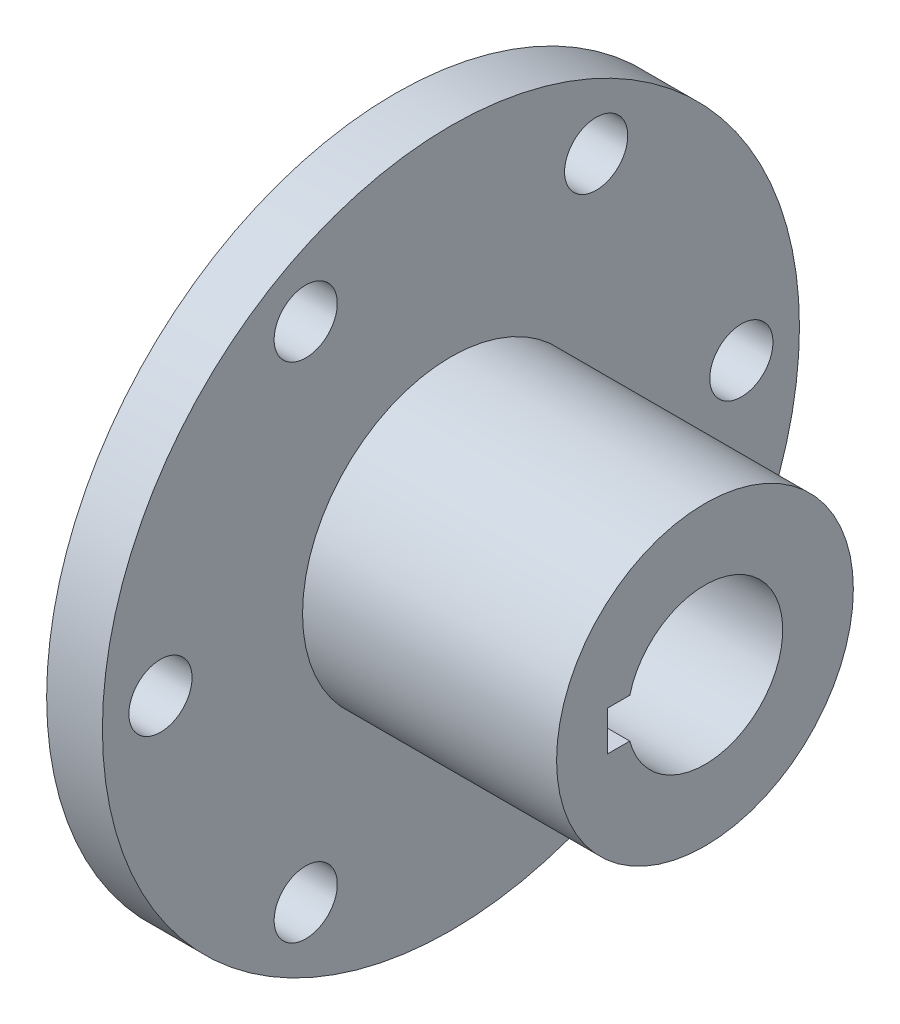
ISO-10303-21;
HEADER;
FILE_DESCRIPTION(('STEP AP214'),'2;1');
FILE_NAME('part.step','',(''),(''),'','','');
FILE_SCHEMA(('AUTOMOTIVE_DESIGN { 1 0 10303 214 1 1 1 1 }'));
ENDSEC;
DATA;
#1=APPLICATION_CONTEXT('core data for automotive mechanical design processes');
#2=APPLICATION_PROTOCOL_DEFINITION('international standard','automotive_design',2000,#1);
#3=PRODUCT_CONTEXT('',#1,'mechanical');
#4=PRODUCT('Part','Part','',(#3));
#5=PRODUCT_RELATED_PRODUCT_CATEGORY('part','',(#4));
#6=PRODUCT_DEFINITION_FORMATION('','',#4);
#7=PRODUCT_DEFINITION_CONTEXT('part definition',#1,'design');
#8=PRODUCT_DEFINITION('design','',#6,#7);
#9=PRODUCT_DEFINITION_SHAPE('','',#8);
#10=(LENGTH_UNIT() NAMED_UNIT(*) SI_UNIT(.MILLI.,.METRE.));
#11=(NAMED_UNIT(*) PLANE_ANGLE_UNIT() SI_UNIT($,.RADIAN.));
#12=(NAMED_UNIT(*) SI_UNIT($,.STERADIAN.) SOLID_ANGLE_UNIT());
#13=UNCERTAINTY_MEASURE_WITH_UNIT(LENGTH_MEASURE(1.E-05),#10,'distance_accuracy_value','');
#14=(GEOMETRIC_REPRESENTATION_CONTEXT(3) GLOBAL_UNCERTAINTY_ASSIGNED_CONTEXT((#13)) GLOBAL_UNIT_ASSIGNED_CONTEXT((#10,
#11,#12)) REPRESENTATION_CONTEXT('',''));
#15=CARTESIAN_POINT('',(0.,0.,0.));
#16=DIRECTION('',(0.,0.,1.));
#17=DIRECTION('',(1.,0.,0.));
#18=AXIS2_PLACEMENT_3D('',#15,#16,#17);
#19=CARTESIAN_POINT('',(-17.6070662460568,0.,0.));
#20=DIRECTION('',(1.,0.,0.));
#21=DIRECTION('',(0.,0.,-1.));
#22=AXIS2_PLACEMENT_3D('',#19,#20,#21);
#23=CYLINDRICAL_SURFACE('',#22,12.1666);
#24=CARTESIAN_POINT('',(7.79293375394323,0.,0.));
#25=DIRECTION('',(1.,0.,0.));
#26=DIRECTION('',(0.,0.,-1.));
#27=AXIS2_PLACEMENT_3D('',#24,#25,#26);
#28=CIRCLE('',#27,12.1666);
#29=CARTESIAN_POINT('',(7.79293375394323,0.,-12.1666));
#30=VERTEX_POINT('',#29);
#31=EDGE_CURVE('E152',#30,#30,#28,.F.);
#32=ORIENTED_EDGE('',*,*,#31,.T.);
#33=EDGE_LOOP('',(#32));
#34=FACE_BOUND('',#33,.T.);
#35=CARTESIAN_POINT('',(-13.0350662460568,0.,0.));
#36=DIRECTION('',(1.,0.,0.));
#37=DIRECTION('',(0.,0.,-1.));
#38=AXIS2_PLACEMENT_3D('',#35,#36,#37);
#39=CIRCLE('',#38,12.1666);
#40=CARTESIAN_POINT('',(-13.0350662460568,0.,-12.1666));
#41=VERTEX_POINT('',#40);
#42=EDGE_CURVE('E20',#41,#41,#39,.T.);
#43=ORIENTED_EDGE('',*,*,#42,.T.);
#44=EDGE_LOOP('',(#43));
#45=FACE_BOUND('',#44,.T.);
#46=ADVANCED_FACE('F17',(#34,#45),#23,.T.);
#47=CARTESIAN_POINT('',(-13.0350662460568,0.,12.1666));
#48=DIRECTION('',(-1.,0.,0.));
#49=DIRECTION('',(0.,0.,1.));
#50=AXIS2_PLACEMENT_3D('',#47,#48,#49);
#51=PLANE('',#50);
#52=ORIENTED_EDGE('',*,*,#42,.F.);
#53=EDGE_LOOP('',(#52));
#54=FACE_BOUND('',#53,.T.);
#55=CARTESIAN_POINT('',(-13.0350662460568,0.,23.8125));
#56=DIRECTION('',(-1.,0.,0.));
#57=DIRECTION('',(0.,0.,1.));
#58=AXIS2_PLACEMENT_3D('',#55,#56,#57);
#59=CIRCLE('',#58,2.5908);
#60=CARTESIAN_POINT('',(-13.0350662460568,0.,26.4033));
#61=VERTEX_POINT('',#60);
#62=EDGE_CURVE('E109',#61,#61,#59,.T.);
#63=ORIENTED_EDGE('',*,*,#62,.T.);
#64=EDGE_LOOP('',(#63));
#65=FACE_BOUND('',#64,.T.);
#66=CARTESIAN_POINT('',(-13.0350662460568,20.6222299276169,11.90625));
#67=DIRECTION('',(-1.,0.,0.));
#68=DIRECTION('',(0.,0.,1.));
#69=AXIS2_PLACEMENT_3D('',#66,#67,#68);
#70=CIRCLE('',#69,2.5908);
#71=CARTESIAN_POINT('',(-13.0350662460568,20.6222299276169,14.49705));
#72=VERTEX_POINT('',#71);
#73=EDGE_CURVE('E135',#72,#72,#70,.T.);
#74=ORIENTED_EDGE('',*,*,#73,.T.);
#75=EDGE_LOOP('',(#74));
#76=FACE_BOUND('',#75,.T.);
#77=CARTESIAN_POINT('',(-13.0350662460568,20.6222299276169,-11.90625));
#78=DIRECTION('',(-1.,0.,0.));
#79=DIRECTION('',(0.,0.,1.));
#80=AXIS2_PLACEMENT_3D('',#77,#78,#79);
#81=CIRCLE('',#80,2.5908);
#82=CARTESIAN_POINT('',(-13.0350662460568,20.6222299276169,-9.31545));
#83=VERTEX_POINT('',#82);
#84=EDGE_CURVE('E138',#83,#83,#81,.T.);
#85=ORIENTED_EDGE('',*,*,#84,.T.);
#86=EDGE_LOOP('',(#85));
#87=FACE_BOUND('',#86,.T.);
#88=CARTESIAN_POINT('',(-13.0350662460568,0.,-23.8125));
#89=DIRECTION('',(-1.,0.,0.));
#90=DIRECTION('',(0.,0.,1.));
#91=AXIS2_PLACEMENT_3D('',#88,#89,#90);
#92=CIRCLE('',#91,2.5908);
#93=CARTESIAN_POINT('',(-13.0350662460568,0.,-21.2217));
#94=VERTEX_POINT('',#93);
#95=EDGE_CURVE('E141',#94,#94,#92,.T.);
#96=ORIENTED_EDGE('',*,*,#95,.T.);
#97=EDGE_LOOP('',(#96));
#98=FACE_BOUND('',#97,.T.);
#99=CARTESIAN_POINT('',(-13.0350662460568,-20.6222299276169,-11.90625));
#100=DIRECTION('',(-1.,0.,0.));
#101=DIRECTION('',(0.,0.,1.));
#102=AXIS2_PLACEMENT_3D('',#99,#100,#101);
#103=CIRCLE('',#102,2.5908);
#104=CARTESIAN_POINT('',(-13.0350662460568,-20.6222299276169,-9.31545));
#105=VERTEX_POINT('',#104);
#106=EDGE_CURVE('E144',#105,#105,#103,.T.);
#107=ORIENTED_EDGE('',*,*,#106,.T.);
#108=EDGE_LOOP('',(#107));
#109=FACE_BOUND('',#108,.T.);
#110=CARTESIAN_POINT('',(-13.0350662460568,-20.6222299276169,11.90625));
#111=DIRECTION('',(-1.,0.,0.));
#112=DIRECTION('',(0.,0.,1.));
#113=AXIS2_PLACEMENT_3D('',#110,#111,#112);
#114=CIRCLE('',#113,2.5908);
#115=CARTESIAN_POINT('',(-13.0350662460568,-20.6222299276169,14.49705));
#116=VERTEX_POINT('',#115);
#117=EDGE_CURVE('E147',#116,#116,#114,.T.);
#118=ORIENTED_EDGE('',*,*,#117,.T.);
#119=EDGE_LOOP('',(#118));
#120=FACE_BOUND('',#119,.T.);
#121=CARTESIAN_POINT('',(-13.0350662460568,0.,0.));
#122=DIRECTION('',(-1.,0.,0.));
#123=DIRECTION('',(0.,0.,1.));
#124=AXIS2_PLACEMENT_3D('',#121,#122,#123);
#125=CIRCLE('',#124,28.575);
#126=CARTESIAN_POINT('',(-13.0350662460568,0.,28.575));
#127=VERTEX_POINT('',#126);
#128=EDGE_CURVE('E150',#127,#127,#125,.T.);
#129=ORIENTED_EDGE('',*,*,#128,.F.);
#130=EDGE_LOOP('',(#129));
#131=FACE_BOUND('',#130,.T.);
#132=ADVANCED_FACE('F160',(#54,#65,#76,#87,#98,#109,#120,#131),#51,.F.);
#133=CARTESIAN_POINT('',(7.79293375394323,0.,0.));
#134=DIRECTION('',(-1.,0.,0.));
#135=DIRECTION('',(0.,0.,1.));
#136=AXIS2_PLACEMENT_3D('',#133,#134,#135);
#137=PLANE('',#136);
#138=DIRECTION('',(0.,0.,1.));
#139=VECTOR('',#138,1.);
#140=CARTESIAN_POINT('',(7.79293375394323,-1.6256,0.));
#141=LINE('',#140,#139);
#142=CARTESIAN_POINT('',(7.79293375394323,-1.6256,7.9756));
#143=VERTEX_POINT('',#142);
#144=CARTESIAN_POINT('',(7.79293375394323,-1.6256,6.16466948019113));
#145=VERTEX_POINT('',#144);
#146=EDGE_CURVE('E58',#143,#145,#141,.F.);
#147=ORIENTED_EDGE('',*,*,#146,.F.);
#148=DIRECTION('',(0.,1.,0.));
#149=VECTOR('',#148,1.);
#150=CARTESIAN_POINT('',(7.79293375394323,-1.6256,7.9756));
#151=LINE('',#150,#149);
#152=CARTESIAN_POINT('',(7.79293375394323,1.6256,7.9756));
#153=VERTEX_POINT('',#152);
#154=EDGE_CURVE('E71',#153,#143,#151,.F.);
#155=ORIENTED_EDGE('',*,*,#154,.F.);
#156=DIRECTION('',(0.,0.,-1.));
#157=VECTOR('',#156,1.);
#158=CARTESIAN_POINT('',(7.79293375394323,1.6256,7.9756));
#159=LINE('',#158,#157);
#160=CARTESIAN_POINT('',(7.79293375394323,1.6256,6.16466948019113));
#161=VERTEX_POINT('',#160);
#162=EDGE_CURVE('E51',#161,#153,#159,.F.);
#163=ORIENTED_EDGE('',*,*,#162,.F.);
#164=CARTESIAN_POINT('',(7.79293375394323,0.,0.));
#165=DIRECTION('',(-1.,0.,0.));
#166=DIRECTION('',(0.,0.,1.));
#167=AXIS2_PLACEMENT_3D('',#164,#165,#166);
#168=CIRCLE('',#167,6.3754);
#169=EDGE_CURVE('E97',#161,#145,#168,.T.);
#170=ORIENTED_EDGE('',*,*,#169,.T.);
#171=EDGE_LOOP('',(#147,#155,#163,#170));
#172=FACE_BOUND('',#171,.T.);
#173=ORIENTED_EDGE('',*,*,#31,.F.);
#174=EDGE_LOOP('',(#173));
#175=FACE_BOUND('',#174,.T.);
#176=ADVANCED_FACE('F163',(#172,#175),#137,.F.);
#177=CARTESIAN_POINT('',(-13.0350662460568,0.,0.));
#178=DIRECTION('',(-1.,0.,0.));
#179=DIRECTION('',(0.,0.,1.));
#180=AXIS2_PLACEMENT_3D('',#177,#178,#179);
#181=CYLINDRICAL_SURFACE('',#180,28.575);
#182=ORIENTED_EDGE('',*,*,#128,.T.);
#183=EDGE_LOOP('',(#182));
#184=FACE_BOUND('',#183,.T.);
#185=CARTESIAN_POINT('',(-17.6070662460568,0.,0.));
#186=DIRECTION('',(-1.,0.,0.));
#187=DIRECTION('',(0.,0.,1.));
#188=AXIS2_PLACEMENT_3D('',#185,#186,#187);
#189=CIRCLE('',#188,28.575);
#190=CARTESIAN_POINT('',(-17.6070662460568,0.,28.575));
#191=VERTEX_POINT('',#190);
#192=EDGE_CURVE('E129',#191,#191,#189,.F.);
#193=ORIENTED_EDGE('',*,*,#192,.T.);
#194=EDGE_LOOP('',(#193));
#195=FACE_BOUND('',#194,.T.);
#196=ADVANCED_FACE('F178',(#184,#195),#181,.T.);
#197=CARTESIAN_POINT('',(-123.75109941199,-20.6222299276169,11.90625));
#198=DIRECTION('',(-1.,0.,0.));
#199=DIRECTION('',(0.,0.,1.));
#200=AXIS2_PLACEMENT_3D('',#197,#198,#199);
#201=CYLINDRICAL_SURFACE('',#200,2.5908);
#202=ORIENTED_EDGE('',*,*,#117,.F.);
#203=EDGE_LOOP('',(#202));
#204=FACE_BOUND('',#203,.T.);
#205=CARTESIAN_POINT('',(-17.6070662460568,-20.6222299276169,11.90625));
#206=DIRECTION('',(-1.,0.,0.));
#207=DIRECTION('',(0.,0.,1.));
#208=AXIS2_PLACEMENT_3D('',#205,#206,#207);
#209=CIRCLE('',#208,2.5908);
#210=CARTESIAN_POINT('',(-17.6070662460568,-20.6222299276169,14.49705));
#211=VERTEX_POINT('',#210);
#212=EDGE_CURVE('E126',#211,#211,#209,.T.);
#213=ORIENTED_EDGE('',*,*,#212,.T.);
#214=EDGE_LOOP('',(#213));
#215=FACE_BOUND('',#214,.T.);
#216=ADVANCED_FACE('F181',(#204,#215),#201,.F.);
#217=CARTESIAN_POINT('',(-123.75109941199,-20.6222299276169,-11.90625));
#218=DIRECTION('',(-1.,0.,0.));
#219=DIRECTION('',(0.,0.,1.));
#220=AXIS2_PLACEMENT_3D('',#217,#218,#219);
#221=CYLINDRICAL_SURFACE('',#220,2.5908);
#222=ORIENTED_EDGE('',*,*,#106,.F.);
#223=EDGE_LOOP('',(#222));
#224=FACE_BOUND('',#223,.T.);
#225=CARTESIAN_POINT('',(-17.6070662460568,-20.6222299276169,-11.90625));
#226=DIRECTION('',(-1.,0.,0.));
#227=DIRECTION('',(0.,0.,1.));
#228=AXIS2_PLACEMENT_3D('',#225,#226,#227);
#229=CIRCLE('',#228,2.5908);
#230=CARTESIAN_POINT('',(-17.6070662460568,-20.6222299276169,-9.31545));
#231=VERTEX_POINT('',#230);
#232=EDGE_CURVE('E123',#231,#231,#229,.T.);
#233=ORIENTED_EDGE('',*,*,#232,.T.);
#234=EDGE_LOOP('',(#233));
#235=FACE_BOUND('',#234,.T.);
#236=ADVANCED_FACE('F216',(#224,#235),#221,.F.);
#237=CARTESIAN_POINT('',(-123.75109941199,0.,-23.8125));
#238=DIRECTION('',(-1.,0.,0.));
#239=DIRECTION('',(0.,0.,1.));
#240=AXIS2_PLACEMENT_3D('',#237,#238,#239);
#241=CYLINDRICAL_SURFACE('',#240,2.5908);
#242=ORIENTED_EDGE('',*,*,#95,.F.);
#243=EDGE_LOOP('',(#242));
#244=FACE_BOUND('',#243,.T.);
#245=CARTESIAN_POINT('',(-17.6070662460568,0.,-23.8125));
#246=DIRECTION('',(-1.,0.,0.));
#247=DIRECTION('',(0.,0.,1.));
#248=AXIS2_PLACEMENT_3D('',#245,#246,#247);
#249=CIRCLE('',#248,2.5908);
#250=CARTESIAN_POINT('',(-17.6070662460568,0.,-21.2217));
#251=VERTEX_POINT('',#250);
#252=EDGE_CURVE('E120',#251,#251,#249,.T.);
#253=ORIENTED_EDGE('',*,*,#252,.T.);
#254=EDGE_LOOP('',(#253));
#255=FACE_BOUND('',#254,.T.);
#256=ADVANCED_FACE('F212',(#244,#255),#241,.F.);
#257=CARTESIAN_POINT('',(-123.75109941199,20.6222299276169,-11.90625));
#258=DIRECTION('',(-1.,0.,0.));
#259=DIRECTION('',(0.,0.,1.));
#260=AXIS2_PLACEMENT_3D('',#257,#258,#259);
#261=CYLINDRICAL_SURFACE('',#260,2.5908);
#262=ORIENTED_EDGE('',*,*,#84,.F.);
#263=EDGE_LOOP('',(#262));
#264=FACE_BOUND('',#263,.T.);
#265=CARTESIAN_POINT('',(-17.6070662460568,20.6222299276169,-11.90625));
#266=DIRECTION('',(-1.,0.,0.));
#267=DIRECTION('',(0.,0.,1.));
#268=AXIS2_PLACEMENT_3D('',#265,#266,#267);
#269=CIRCLE('',#268,2.5908);
#270=CARTESIAN_POINT('',(-17.6070662460568,20.6222299276169,-9.31545));
#271=VERTEX_POINT('',#270);
#272=EDGE_CURVE('E117',#271,#271,#269,.T.);
#273=ORIENTED_EDGE('',*,*,#272,.T.);
#274=EDGE_LOOP('',(#273));
#275=FACE_BOUND('',#274,.T.);
#276=ADVANCED_FACE('F208',(#264,#275),#261,.F.);
#277=CARTESIAN_POINT('',(-123.75109941199,20.6222299276169,11.90625));
#278=DIRECTION('',(-1.,0.,0.));
#279=DIRECTION('',(0.,0.,1.));
#280=AXIS2_PLACEMENT_3D('',#277,#278,#279);
#281=CYLINDRICAL_SURFACE('',#280,2.5908);
#282=ORIENTED_EDGE('',*,*,#73,.F.);
#283=EDGE_LOOP('',(#282));
#284=FACE_BOUND('',#283,.T.);
#285=CARTESIAN_POINT('',(-17.6070662460568,20.6222299276169,11.90625));
#286=DIRECTION('',(-1.,0.,0.));
#287=DIRECTION('',(0.,0.,1.));
#288=AXIS2_PLACEMENT_3D('',#285,#286,#287);
#289=CIRCLE('',#288,2.5908);
#290=CARTESIAN_POINT('',(-17.6070662460568,20.6222299276169,14.49705));
#291=VERTEX_POINT('',#290);
#292=EDGE_CURVE('E86',#291,#291,#289,.T.);
#293=ORIENTED_EDGE('',*,*,#292,.T.);
#294=EDGE_LOOP('',(#293));
#295=FACE_BOUND('',#294,.T.);
#296=ADVANCED_FACE('F204',(#284,#295),#281,.F.);
#297=CARTESIAN_POINT('',(-123.75109941199,0.,23.8125));
#298=DIRECTION('',(-1.,0.,0.));
#299=DIRECTION('',(0.,0.,1.));
#300=AXIS2_PLACEMENT_3D('',#297,#298,#299);
#301=CYLINDRICAL_SURFACE('',#300,2.5908);
#302=ORIENTED_EDGE('',*,*,#62,.F.);
#303=EDGE_LOOP('',(#302));
#304=FACE_BOUND('',#303,.T.);
#305=CARTESIAN_POINT('',(-17.6070662460568,0.,23.8125));
#306=DIRECTION('',(-1.,0.,0.));
#307=DIRECTION('',(0.,0.,1.));
#308=AXIS2_PLACEMENT_3D('',#305,#306,#307);
#309=CIRCLE('',#308,2.5908);
#310=CARTESIAN_POINT('',(-17.6070662460568,0.,26.4033));
#311=VERTEX_POINT('',#310);
#312=EDGE_CURVE('E83',#311,#311,#309,.T.);
#313=ORIENTED_EDGE('',*,*,#312,.T.);
#314=EDGE_LOOP('',(#313));
#315=FACE_BOUND('',#314,.T.);
#316=ADVANCED_FACE('F201',(#304,#315),#301,.F.);
#317=CARTESIAN_POINT('',(-102.92309941199,-1.6256,0.));
#318=DIRECTION('',(0.,1.,0.));
#319=DIRECTION('',(0.,0.,1.));
#320=AXIS2_PLACEMENT_3D('',#317,#318,#319);
#321=PLANE('',#320);
#322=DIRECTION('',(0.,0.,-1.));
#323=VECTOR('',#322,1.);
#324=CARTESIAN_POINT('',(-17.6070662460568,-1.6256,38.1));
#325=LINE('',#324,#323);
#326=CARTESIAN_POINT('',(-17.6070662460568,-1.6256,6.16466948019113));
#327=VERTEX_POINT('',#326);
#328=CARTESIAN_POINT('',(-17.6070662460568,-1.6256,7.9756));
#329=VERTEX_POINT('',#328);
#330=EDGE_CURVE('E78',#327,#329,#325,.F.);
#331=ORIENTED_EDGE('',*,*,#330,.T.);
#332=DIRECTION('',(-1.,0.,0.));
#333=VECTOR('',#332,1.);
#334=CARTESIAN_POINT('',(-102.92309941199,-1.6256,7.9756));
#335=LINE('',#334,#333);
#336=EDGE_CURVE('E66',#143,#329,#335,.T.);
#337=ORIENTED_EDGE('',*,*,#336,.F.);
#338=ORIENTED_EDGE('',*,*,#146,.T.);
#339=DIRECTION('',(-1.,0.,0.));
#340=VECTOR('',#339,1.);
#341=CARTESIAN_POINT('',(-102.92309941199,-1.6256,6.16466948019113));
#342=LINE('',#341,#340);
#343=EDGE_CURVE('E82',#145,#327,#342,.T.);
#344=ORIENTED_EDGE('',*,*,#343,.T.);
#345=EDGE_LOOP('',(#331,#337,#338,#344));
#346=FACE_BOUND('',#345,.T.);
#347=ADVANCED_FACE('F81',(#346),#321,.T.);
#348=CARTESIAN_POINT('',(-102.92309941199,-1.6256,7.9756));
#349=DIRECTION('',(0.,0.,-1.));
#350=DIRECTION('',(-1.,0.,0.));
#351=AXIS2_PLACEMENT_3D('',#348,#349,#350);
#352=PLANE('',#351);
#353=ORIENTED_EDGE('',*,*,#154,.T.);
#354=ORIENTED_EDGE('',*,*,#336,.T.);
#355=DIRECTION('',(0.,1.,0.));
#356=VECTOR('',#355,1.);
#357=CARTESIAN_POINT('',(-17.6070662460568,0.,7.9756));
#358=LINE('',#357,#356);
#359=CARTESIAN_POINT('',(-17.6070662460568,1.6256,7.9756));
#360=VERTEX_POINT('',#359);
#361=EDGE_CURVE('E70',#329,#360,#358,.T.);
#362=ORIENTED_EDGE('',*,*,#361,.T.);
#363=DIRECTION('',(1.,0.,0.));
#364=VECTOR('',#363,1.);
#365=CARTESIAN_POINT('',(-102.92309941199,1.6256,7.9756));
#366=LINE('',#365,#364);
#367=EDGE_CURVE('E95',#153,#360,#366,.F.);
#368=ORIENTED_EDGE('',*,*,#367,.F.);
#369=EDGE_LOOP('',(#353,#354,#362,#368));
#370=FACE_BOUND('',#369,.T.);
#371=ADVANCED_FACE('F68',(#370),#352,.T.);
#372=CARTESIAN_POINT('',(-102.92309941199,1.6256,7.9756));
#373=DIRECTION('',(0.,-1.,0.));
#374=DIRECTION('',(0.,0.,-1.));
#375=AXIS2_PLACEMENT_3D('',#372,#373,#374);
#376=PLANE('',#375);
#377=ORIENTED_EDGE('',*,*,#162,.T.);
#378=ORIENTED_EDGE('',*,*,#367,.T.);
#379=DIRECTION('',(0.,0.,-1.));
#380=VECTOR('',#379,1.);
#381=CARTESIAN_POINT('',(-17.6070662460568,1.6256,38.1));
#382=LINE('',#381,#380);
#383=CARTESIAN_POINT('',(-17.6070662460568,1.6256,6.16466948019113));
#384=VERTEX_POINT('',#383);
#385=EDGE_CURVE('E26',#360,#384,#382,.T.);
#386=ORIENTED_EDGE('',*,*,#385,.T.);
#387=DIRECTION('',(-1.,0.,0.));
#388=VECTOR('',#387,1.);
#389=CARTESIAN_POINT('',(-102.92309941199,1.6256,6.16466948019113));
#390=LINE('',#389,#388);
#391=EDGE_CURVE('E34',#384,#161,#390,.F.);
#392=ORIENTED_EDGE('',*,*,#391,.T.);
#393=EDGE_LOOP('',(#377,#378,#386,#392));
#394=FACE_BOUND('',#393,.T.);
#395=ADVANCED_FACE('F192',(#394),#376,.T.);
#396=CARTESIAN_POINT('',(-102.92309941199,0.,0.));
#397=DIRECTION('',(-1.,0.,0.));
#398=DIRECTION('',(0.,0.,1.));
#399=AXIS2_PLACEMENT_3D('',#396,#397,#398);
#400=CYLINDRICAL_SURFACE('',#399,6.3754);
#401=ORIENTED_EDGE('',*,*,#391,.F.);
#402=CARTESIAN_POINT('',(-17.6070662460568,0.,0.));
#403=DIRECTION('',(-1.,0.,0.));
#404=DIRECTION('',(0.,0.,1.));
#405=AXIS2_PLACEMENT_3D('',#402,#403,#404);
#406=CIRCLE('',#405,6.3754);
#407=EDGE_CURVE('E11',#384,#327,#406,.T.);
#408=ORIENTED_EDGE('',*,*,#407,.T.);
#409=ORIENTED_EDGE('',*,*,#343,.F.);
#410=ORIENTED_EDGE('',*,*,#169,.F.);
#411=EDGE_LOOP('',(#401,#408,#409,#410));
#412=FACE_BOUND('',#411,.T.);
#413=ADVANCED_FACE('F186',(#412),#400,.F.);
#414=CARTESIAN_POINT('',(-17.6070662460568,0.,38.1));
#415=DIRECTION('',(1.,0.,0.));
#416=DIRECTION('',(0.,0.,-1.));
#417=AXIS2_PLACEMENT_3D('',#414,#415,#416);
#418=PLANE('',#417);
#419=ORIENTED_EDGE('',*,*,#385,.F.);
#420=ORIENTED_EDGE('',*,*,#361,.F.);
#421=ORIENTED_EDGE('',*,*,#330,.F.);
#422=ORIENTED_EDGE('',*,*,#407,.F.);
#423=EDGE_LOOP('',(#419,#420,#421,#422));
#424=FACE_BOUND('',#423,.T.);
#425=ORIENTED_EDGE('',*,*,#312,.F.);
#426=EDGE_LOOP('',(#425));
#427=FACE_BOUND('',#426,.T.);
#428=ORIENTED_EDGE('',*,*,#292,.F.);
#429=EDGE_LOOP('',(#428));
#430=FACE_BOUND('',#429,.T.);
#431=ORIENTED_EDGE('',*,*,#272,.F.);
#432=EDGE_LOOP('',(#431));
#433=FACE_BOUND('',#432,.T.);
#434=ORIENTED_EDGE('',*,*,#252,.F.);
#435=EDGE_LOOP('',(#434));
#436=FACE_BOUND('',#435,.T.);
#437=ORIENTED_EDGE('',*,*,#232,.F.);
#438=EDGE_LOOP('',(#437));
#439=FACE_BOUND('',#438,.T.);
#440=ORIENTED_EDGE('',*,*,#212,.F.);
#441=EDGE_LOOP('',(#440));
#442=FACE_BOUND('',#441,.T.);
#443=ORIENTED_EDGE('',*,*,#192,.F.);
#444=EDGE_LOOP('',(#443));
#445=FACE_BOUND('',#444,.T.);
#446=ADVANCED_FACE('F76',(#424,#427,#430,#433,#436,#439,#442,#445),#418,.F.);
#447=CLOSED_SHELL('',(#46,#132,#176,#196,#216,#236,#256,#276,#296,#316,#347,#371,#395,#413,#446));
#448=MANIFOLD_SOLID_BREP('B1',#447);
#449=ADVANCED_BREP_SHAPE_REPRESENTATION('',(#18,#448),#14);
#450=SHAPE_DEFINITION_REPRESENTATION(#9,#449);
ENDSEC;
END-ISO-10303-21;
